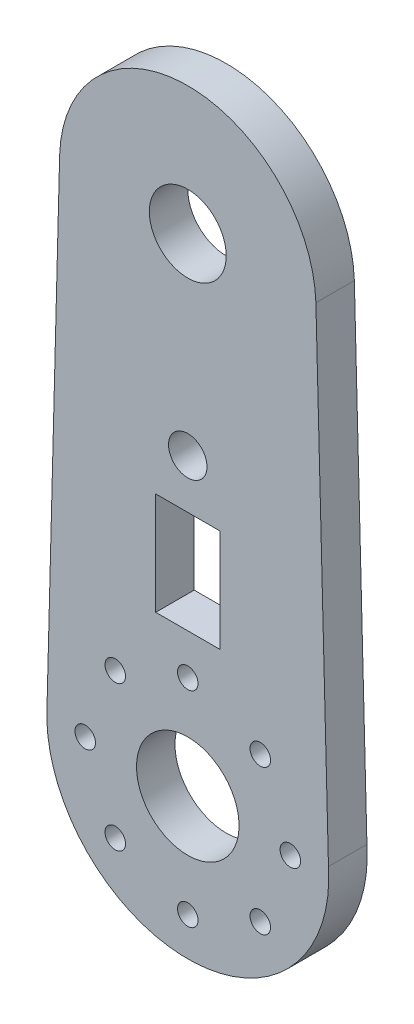
ISO-10303-21;
HEADER;
FILE_DESCRIPTION(('STEP AP214'),'2;1');
FILE_NAME('part.step','',(''),(''),'','','');
FILE_SCHEMA(('AUTOMOTIVE_DESIGN { 1 0 10303 214 1 1 1 1 }'));
ENDSEC;
DATA;
#1=APPLICATION_CONTEXT('core data for automotive mechanical design processes');
#2=APPLICATION_PROTOCOL_DEFINITION('international standard','automotive_design',2000,#1);
#3=PRODUCT_CONTEXT('',#1,'mechanical');
#4=PRODUCT('Part','Part','',(#3));
#5=PRODUCT_RELATED_PRODUCT_CATEGORY('part','',(#4));
#6=PRODUCT_DEFINITION_FORMATION('','',#4);
#7=PRODUCT_DEFINITION_CONTEXT('part definition',#1,'design');
#8=PRODUCT_DEFINITION('design','',#6,#7);
#9=PRODUCT_DEFINITION_SHAPE('','',#8);
#10=(LENGTH_UNIT() NAMED_UNIT(*) SI_UNIT(.MILLI.,.METRE.));
#11=(NAMED_UNIT(*) PLANE_ANGLE_UNIT() SI_UNIT($,.RADIAN.));
#12=(NAMED_UNIT(*) SI_UNIT($,.STERADIAN.) SOLID_ANGLE_UNIT());
#13=UNCERTAINTY_MEASURE_WITH_UNIT(LENGTH_MEASURE(1.E-05),#10,'distance_accuracy_value','');
#14=(GEOMETRIC_REPRESENTATION_CONTEXT(3) GLOBAL_UNCERTAINTY_ASSIGNED_CONTEXT((#13)) GLOBAL_UNIT_ASSIGNED_CONTEXT((#10,
#11,#12)) REPRESENTATION_CONTEXT('',''));
#15=CARTESIAN_POINT('',(0.,0.,0.));
#16=DIRECTION('',(0.,0.,1.));
#17=DIRECTION('',(1.,0.,0.));
#18=AXIS2_PLACEMENT_3D('',#15,#16,#17);
#19=CARTESIAN_POINT('',(0.,0.,0.));
#20=DIRECTION('',(0.,0.,1.));
#21=DIRECTION('',(1.,0.,0.));
#22=AXIS2_PLACEMENT_3D('',#19,#20,#21);
#23=CYLINDRICAL_SURFACE('',#22,10.9999999999999);
#24=CARTESIAN_POINT('',(0.,0.,3.));
#25=DIRECTION('',(0.,0.,1.));
#26=DIRECTION('',(1.,0.,0.));
#27=AXIS2_PLACEMENT_3D('',#24,#25,#26);
#28=CIRCLE('',#27,10.9999999999999);
#29=CARTESIAN_POINT('',(-10.9758499128059,0.728504421097057,3.));
#30=VERTEX_POINT('',#29);
#31=CARTESIAN_POINT('',(10.9758499128058,0.728504421097189,3.));
#32=VERTEX_POINT('',#31);
#33=EDGE_CURVE('E134',#30,#32,#28,.T.);
#34=ORIENTED_EDGE('',*,*,#33,.F.);
#35=DIRECTION('',(0.,0.,1.));
#36=VECTOR('',#35,1.);
#37=CARTESIAN_POINT('',(-10.9758499128059,0.728504421097057,0.));
#38=LINE('',#37,#36);
#39=CARTESIAN_POINT('',(-10.9758499128059,0.728504421097057,0.));
#40=VERTEX_POINT('',#39);
#41=EDGE_CURVE('E11',#40,#30,#38,.T.);
#42=ORIENTED_EDGE('',*,*,#41,.F.);
#43=CARTESIAN_POINT('',(0.,0.,0.));
#44=DIRECTION('',(0.,0.,1.));
#45=DIRECTION('',(1.,0.,0.));
#46=AXIS2_PLACEMENT_3D('',#43,#44,#45);
#47=CIRCLE('',#46,10.9999999999999);
#48=CARTESIAN_POINT('',(10.9758499128058,0.728504421097189,0.));
#49=VERTEX_POINT('',#48);
#50=EDGE_CURVE('E138',#40,#49,#47,.T.);
#51=ORIENTED_EDGE('',*,*,#50,.T.);
#52=DIRECTION('',(0.,0.,1.));
#53=VECTOR('',#52,1.);
#54=CARTESIAN_POINT('',(10.9758499128058,0.728504421097189,0.));
#55=LINE('',#54,#53);
#56=EDGE_CURVE('E35',#49,#32,#55,.T.);
#57=ORIENTED_EDGE('',*,*,#56,.T.);
#58=EDGE_LOOP('',(#34,#42,#51,#57));
#59=FACE_BOUND('',#58,.T.);
#60=ADVANCED_FACE('F32',(#59),#23,.T.);
#61=CARTESIAN_POINT('',(-9.99450983672495,38.3313202734657,0.));
#62=DIRECTION('',(-0.999659633690564,0.0260886329585659,0.));
#63=DIRECTION('',(-0.0260886329585659,-0.999659633690564,0.));
#64=AXIS2_PLACEMENT_3D('',#61,#62,#63);
#65=PLANE('',#64);
#66=DIRECTION('',(-0.0260886329585659,-0.999659633690564,0.));
#67=VECTOR('',#66,1.);
#68=CARTESIAN_POINT('',(-9.99450983672495,38.3313202734657,3.));
#69=LINE('',#68,#67);
#70=CARTESIAN_POINT('',(-9.99450983672495,38.3313202734657,3.));
#71=VERTEX_POINT('',#70);
#72=EDGE_CURVE('E142',#71,#30,#69,.T.);
#73=ORIENTED_EDGE('',*,*,#72,.F.);
#74=DIRECTION('',(0.,0.,1.));
#75=VECTOR('',#74,1.);
#76=CARTESIAN_POINT('',(-9.99450983672495,38.3313202734657,0.));
#77=LINE('',#76,#75);
#78=CARTESIAN_POINT('',(-9.99450983672495,38.3313202734657,0.));
#79=VERTEX_POINT('',#78);
#80=EDGE_CURVE('E40',#79,#71,#77,.T.);
#81=ORIENTED_EDGE('',*,*,#80,.F.);
#82=DIRECTION('',(-0.0260886329585659,-0.999659633690564,0.));
#83=VECTOR('',#82,1.);
#84=CARTESIAN_POINT('',(-9.99450983672495,38.3313202734657,0.));
#85=LINE('',#84,#83);
#86=EDGE_CURVE('E148',#79,#40,#85,.T.);
#87=ORIENTED_EDGE('',*,*,#86,.T.);
#88=ORIENTED_EDGE('',*,*,#41,.T.);
#89=EDGE_LOOP('',(#73,#81,#87,#88));
#90=FACE_BOUND('',#89,.T.);
#91=ADVANCED_FACE('F174',(#90),#65,.T.);
#92=CARTESIAN_POINT('',(0.,38.,0.));
#93=DIRECTION('',(0.,0.,1.));
#94=DIRECTION('',(1.,0.,0.));
#95=AXIS2_PLACEMENT_3D('',#92,#93,#94);
#96=CYLINDRICAL_SURFACE('',#95,10.);
#97=CARTESIAN_POINT('',(0.,38.,3.));
#98=DIRECTION('',(0.,0.,1.));
#99=DIRECTION('',(1.,0.,0.));
#100=AXIS2_PLACEMENT_3D('',#97,#98,#99);
#101=CIRCLE('',#100,10.);
#102=CARTESIAN_POINT('',(9.9945098367248,38.3313202734665,3.));
#103=VERTEX_POINT('',#102);
#104=EDGE_CURVE('E156',#103,#71,#101,.T.);
#105=ORIENTED_EDGE('',*,*,#104,.F.);
#106=DIRECTION('',(0.,0.,1.));
#107=VECTOR('',#106,1.);
#108=CARTESIAN_POINT('',(9.9945098367248,38.3313202734665,0.));
#109=LINE('',#108,#107);
#110=CARTESIAN_POINT('',(9.9945098367248,38.3313202734665,0.));
#111=VERTEX_POINT('',#110);
#112=EDGE_CURVE('E161',#111,#103,#109,.T.);
#113=ORIENTED_EDGE('',*,*,#112,.F.);
#114=CARTESIAN_POINT('',(0.,38.,0.));
#115=DIRECTION('',(0.,0.,1.));
#116=DIRECTION('',(1.,0.,0.));
#117=AXIS2_PLACEMENT_3D('',#114,#115,#116);
#118=CIRCLE('',#117,10.);
#119=EDGE_CURVE('E145',#111,#79,#118,.T.);
#120=ORIENTED_EDGE('',*,*,#119,.T.);
#121=ORIENTED_EDGE('',*,*,#80,.T.);
#122=EDGE_LOOP('',(#105,#113,#120,#121));
#123=FACE_BOUND('',#122,.T.);
#124=ADVANCED_FACE('F178',(#123),#96,.T.);
#125=CARTESIAN_POINT('',(10.9758499128058,0.728504421097189,0.));
#126=DIRECTION('',(0.999659633690564,0.0260886329585659,0.));
#127=DIRECTION('',(-0.0260886329585659,0.999659633690564,0.));
#128=AXIS2_PLACEMENT_3D('',#125,#126,#127);
#129=PLANE('',#128);
#130=DIRECTION('',(-0.0260886329585659,0.999659633690564,0.));
#131=VECTOR('',#130,1.);
#132=CARTESIAN_POINT('',(10.9758499128058,0.728504421097189,3.));
#133=LINE('',#132,#131);
#134=EDGE_CURVE('E153',#32,#103,#133,.T.);
#135=ORIENTED_EDGE('',*,*,#134,.F.);
#136=ORIENTED_EDGE('',*,*,#56,.F.);
#137=DIRECTION('',(-0.0260886329585659,0.999659633690564,0.));
#138=VECTOR('',#137,1.);
#139=CARTESIAN_POINT('',(10.9758499128058,0.728504421097189,0.));
#140=LINE('',#139,#138);
#141=EDGE_CURVE('E141',#49,#111,#140,.T.);
#142=ORIENTED_EDGE('',*,*,#141,.T.);
#143=ORIENTED_EDGE('',*,*,#112,.T.);
#144=EDGE_LOOP('',(#135,#136,#142,#143));
#145=FACE_BOUND('',#144,.T.);
#146=ADVANCED_FACE('F169',(#145),#129,.T.);
#147=CARTESIAN_POINT('',(0.,0.,0.));
#148=DIRECTION('',(0.,0.,1.));
#149=DIRECTION('',(1.,0.,0.));
#150=AXIS2_PLACEMENT_3D('',#147,#148,#149);
#151=PLANE('',#150);
#152=CARTESIAN_POINT('',(-5.65685424949236,5.65685424949241,0.));
#153=DIRECTION('',(0.,0.,1.));
#154=DIRECTION('',(1.,0.,0.));
#155=AXIS2_PLACEMENT_3D('',#152,#153,#154);
#156=CIRCLE('',#155,0.800000000000001);
#157=CARTESIAN_POINT('',(-4.85685424949236,5.65685424949241,0.));
#158=VERTEX_POINT('',#157);
#159=EDGE_CURVE('E373',#158,#158,#156,.T.);
#160=ORIENTED_EDGE('',*,*,#159,.T.);
#161=EDGE_LOOP('',(#160));
#162=FACE_BOUND('',#161,.T.);
#163=CARTESIAN_POINT('',(-7.99999999999932,-7.46069872548105E-13,0.));
#164=DIRECTION('',(0.,0.,1.));
#165=DIRECTION('',(1.,0.,0.));
#166=AXIS2_PLACEMENT_3D('',#163,#164,#165);
#167=CIRCLE('',#166,0.800000000000933);
#168=CARTESIAN_POINT('',(-7.19999999999839,-7.46069872548105E-13,0.));
#169=VERTEX_POINT('',#168);
#170=EDGE_CURVE('E381',#169,#169,#167,.T.);
#171=ORIENTED_EDGE('',*,*,#170,.T.);
#172=EDGE_LOOP('',(#171));
#173=FACE_BOUND('',#172,.T.);
#174=CARTESIAN_POINT('',(0.,23.,0.));
#175=DIRECTION('',(0.,0.,1.));
#176=DIRECTION('',(-1.,0.,0.));
#177=AXIS2_PLACEMENT_3D('',#174,#175,#176);
#178=CIRCLE('',#177,1.5);
#179=CARTESIAN_POINT('',(-1.50000000000006,23.,0.));
#180=VERTEX_POINT('',#179);
#181=EDGE_CURVE('E387',#180,#180,#178,.T.);
#182=ORIENTED_EDGE('',*,*,#181,.T.);
#183=EDGE_LOOP('',(#182));
#184=FACE_BOUND('',#183,.T.);
#185=CARTESIAN_POINT('',(0.,0.,0.));
#186=DIRECTION('',(0.,0.,1.));
#187=DIRECTION('',(-1.,0.,0.));
#188=AXIS2_PLACEMENT_3D('',#185,#186,#187);
#189=CIRCLE('',#188,4.);
#190=CARTESIAN_POINT('',(-4.00000000000006,0.,0.));
#191=VERTEX_POINT('',#190);
#192=EDGE_CURVE('E393',#191,#191,#189,.T.);
#193=ORIENTED_EDGE('',*,*,#192,.T.);
#194=EDGE_LOOP('',(#193));
#195=FACE_BOUND('',#194,.T.);
#196=CARTESIAN_POINT('',(0.,38.,0.));
#197=DIRECTION('',(0.,0.,1.));
#198=DIRECTION('',(-1.,0.,0.));
#199=AXIS2_PLACEMENT_3D('',#196,#197,#198);
#200=CIRCLE('',#199,3.);
#201=CARTESIAN_POINT('',(-3.00000000000006,38.,0.));
#202=VERTEX_POINT('',#201);
#203=EDGE_CURVE('E399',#202,#202,#200,.T.);
#204=ORIENTED_EDGE('',*,*,#203,.T.);
#205=EDGE_LOOP('',(#204));
#206=FACE_BOUND('',#205,.T.);
#207=CARTESIAN_POINT('',(-5.65685424949117,-5.65685424949291,0.));
#208=DIRECTION('',(0.,0.,1.));
#209=DIRECTION('',(1.,0.,0.));
#210=AXIS2_PLACEMENT_3D('',#207,#208,#209);
#211=CIRCLE('',#210,0.800000000001323);
#212=CARTESIAN_POINT('',(-4.85685424948985,-5.65685424949291,0.));
#213=VERTEX_POINT('',#212);
#214=EDGE_CURVE('E405',#213,#213,#211,.T.);
#215=ORIENTED_EDGE('',*,*,#214,.T.);
#216=EDGE_LOOP('',(#215));
#217=FACE_BOUND('',#216,.T.);
#218=CARTESIAN_POINT('',(1.42800782021757E-12,-8.,0.));
#219=DIRECTION('',(0.,0.,1.));
#220=DIRECTION('',(1.,0.,0.));
#221=AXIS2_PLACEMENT_3D('',#218,#219,#220);
#222=CIRCLE('',#221,0.80000000000136);
#223=CARTESIAN_POINT('',(0.800000000002788,-8.,0.));
#224=VERTEX_POINT('',#223);
#225=EDGE_CURVE('E411',#224,#224,#222,.T.);
#226=ORIENTED_EDGE('',*,*,#225,.T.);
#227=EDGE_LOOP('',(#226));
#228=FACE_BOUND('',#227,.T.);
#229=CARTESIAN_POINT('',(5.65685424949359,-5.65685424949185,0.));
#230=DIRECTION('',(0.,0.,1.));
#231=DIRECTION('',(1.,0.,0.));
#232=AXIS2_PLACEMENT_3D('',#229,#230,#231);
#233=CIRCLE('',#232,0.800000000001012);
#234=CARTESIAN_POINT('',(6.4568542494946,-5.65685424949185,0.));
#235=VERTEX_POINT('',#234);
#236=EDGE_CURVE('E417',#235,#235,#233,.T.);
#237=ORIENTED_EDGE('',*,*,#236,.T.);
#238=EDGE_LOOP('',(#237));
#239=FACE_BOUND('',#238,.T.);
#240=CARTESIAN_POINT('',(8.00000000000068,7.45090155108787E-13,0.));
#241=DIRECTION('',(0.,0.,1.));
#242=DIRECTION('',(1.,0.,0.));
#243=AXIS2_PLACEMENT_3D('',#240,#241,#242);
#244=CIRCLE('',#243,0.80000000000048);
#245=CARTESIAN_POINT('',(8.80000000000116,7.45090155108787E-13,0.));
#246=VERTEX_POINT('',#245);
#247=EDGE_CURVE('E423',#246,#246,#244,.T.);
#248=ORIENTED_EDGE('',*,*,#247,.T.);
#249=EDGE_LOOP('',(#248));
#250=FACE_BOUND('',#249,.T.);
#251=CARTESIAN_POINT('',(5.65685424949235,5.65685424949242,0.));
#252=DIRECTION('',(0.,0.,1.));
#253=DIRECTION('',(1.,0.,0.));
#254=AXIS2_PLACEMENT_3D('',#251,#252,#253);
#255=CIRCLE('',#254,0.8);
#256=CARTESIAN_POINT('',(6.45685424949235,5.65685424949242,0.));
#257=VERTEX_POINT('',#256);
#258=EDGE_CURVE('E429',#257,#257,#255,.T.);
#259=ORIENTED_EDGE('',*,*,#258,.T.);
#260=EDGE_LOOP('',(#259));
#261=FACE_BOUND('',#260,.T.);
#262=CARTESIAN_POINT('',(0.,8.,0.));
#263=DIRECTION('',(0.,0.,1.));
#264=DIRECTION('',(1.,0.,0.));
#265=AXIS2_PLACEMENT_3D('',#262,#263,#264);
#266=CIRCLE('',#265,0.8);
#267=CARTESIAN_POINT('',(0.799999999999938,8.,0.));
#268=VERTEX_POINT('',#267);
#269=EDGE_CURVE('E128',#268,#268,#266,.T.);
#270=ORIENTED_EDGE('',*,*,#269,.T.);
#271=EDGE_LOOP('',(#270));
#272=FACE_BOUND('',#271,.T.);
#273=DIRECTION('',(-1.,0.,0.));
#274=VECTOR('',#273,1.);
#275=CARTESIAN_POINT('',(-2.50000000000006,19.1690504121899,0.));
#276=LINE('',#275,#274);
#277=CARTESIAN_POINT('',(2.49999999999994,19.1690504121899,0.));
#278=VERTEX_POINT('',#277);
#279=CARTESIAN_POINT('',(-2.50000000000006,19.1690504121899,0.));
#280=VERTEX_POINT('',#279);
#281=EDGE_CURVE('E105',#278,#280,#276,.T.);
#282=ORIENTED_EDGE('',*,*,#281,.T.);
#283=DIRECTION('',(0.,-1.,0.));
#284=VECTOR('',#283,1.);
#285=CARTESIAN_POINT('',(-2.50000000000006,11.1690504121899,0.));
#286=LINE('',#285,#284);
#287=CARTESIAN_POINT('',(-2.50000000000006,11.1690504121899,0.));
#288=VERTEX_POINT('',#287);
#289=EDGE_CURVE('E99',#280,#288,#286,.T.);
#290=ORIENTED_EDGE('',*,*,#289,.T.);
#291=DIRECTION('',(1.,0.,0.));
#292=VECTOR('',#291,1.);
#293=CARTESIAN_POINT('',(-2.50000000000006,11.1690504121899,0.));
#294=LINE('',#293,#292);
#295=CARTESIAN_POINT('',(2.49999999999994,11.1690504121899,0.));
#296=VERTEX_POINT('',#295);
#297=EDGE_CURVE('E108',#288,#296,#294,.T.);
#298=ORIENTED_EDGE('',*,*,#297,.T.);
#299=DIRECTION('',(0.,1.,0.));
#300=VECTOR('',#299,1.);
#301=CARTESIAN_POINT('',(2.49999999999994,11.1690504121899,0.));
#302=LINE('',#301,#300);
#303=EDGE_CURVE('E48',#296,#278,#302,.T.);
#304=ORIENTED_EDGE('',*,*,#303,.T.);
#305=EDGE_LOOP('',(#282,#290,#298,#304));
#306=FACE_BOUND('',#305,.T.);
#307=ORIENTED_EDGE('',*,*,#50,.F.);
#308=ORIENTED_EDGE('',*,*,#86,.F.);
#309=ORIENTED_EDGE('',*,*,#119,.F.);
#310=ORIENTED_EDGE('',*,*,#141,.F.);
#311=EDGE_LOOP('',(#307,#308,#309,#310));
#312=FACE_BOUND('',#311,.T.);
#313=ADVANCED_FACE('F112',(#162,#173,#184,#195,#206,#217,#228,#239,#250,#261,#272,#306,#312),
#151,.F.);
#314=CARTESIAN_POINT('',(0.,0.,3.));
#315=DIRECTION('',(0.,0.,1.));
#316=DIRECTION('',(1.,0.,0.));
#317=AXIS2_PLACEMENT_3D('',#314,#315,#316);
#318=PLANE('',#317);
#319=CARTESIAN_POINT('',(-5.65685424949236,5.65685424949241,3.));
#320=DIRECTION('',(0.,0.,1.));
#321=DIRECTION('',(1.,0.,0.));
#322=AXIS2_PLACEMENT_3D('',#319,#320,#321);
#323=CIRCLE('',#322,0.800000000000001);
#324=CARTESIAN_POINT('',(-4.85685424949236,5.65685424949241,3.));
#325=VERTEX_POINT('',#324);
#326=EDGE_CURVE('E376',#325,#325,#323,.T.);
#327=ORIENTED_EDGE('',*,*,#326,.F.);
#328=EDGE_LOOP('',(#327));
#329=FACE_BOUND('',#328,.T.);
#330=CARTESIAN_POINT('',(-7.99999999999932,-7.46069872548105E-13,3.));
#331=DIRECTION('',(0.,0.,1.));
#332=DIRECTION('',(1.,0.,0.));
#333=AXIS2_PLACEMENT_3D('',#330,#331,#332);
#334=CIRCLE('',#333,0.800000000000933);
#335=CARTESIAN_POINT('',(-7.19999999999839,-7.46069872548105E-13,3.));
#336=VERTEX_POINT('',#335);
#337=EDGE_CURVE('E378',#336,#336,#334,.T.);
#338=ORIENTED_EDGE('',*,*,#337,.F.);
#339=EDGE_LOOP('',(#338));
#340=FACE_BOUND('',#339,.T.);
#341=CARTESIAN_POINT('',(0.,23.,3.));
#342=DIRECTION('',(0.,0.,1.));
#343=DIRECTION('',(-1.,0.,0.));
#344=AXIS2_PLACEMENT_3D('',#341,#342,#343);
#345=CIRCLE('',#344,1.5);
#346=CARTESIAN_POINT('',(-1.50000000000006,23.,3.));
#347=VERTEX_POINT('',#346);
#348=EDGE_CURVE('E384',#347,#347,#345,.T.);
#349=ORIENTED_EDGE('',*,*,#348,.F.);
#350=EDGE_LOOP('',(#349));
#351=FACE_BOUND('',#350,.T.);
#352=CARTESIAN_POINT('',(0.,0.,3.));
#353=DIRECTION('',(0.,0.,1.));
#354=DIRECTION('',(-1.,0.,0.));
#355=AXIS2_PLACEMENT_3D('',#352,#353,#354);
#356=CIRCLE('',#355,4.);
#357=CARTESIAN_POINT('',(-4.00000000000006,0.,3.));
#358=VERTEX_POINT('',#357);
#359=EDGE_CURVE('E390',#358,#358,#356,.T.);
#360=ORIENTED_EDGE('',*,*,#359,.F.);
#361=EDGE_LOOP('',(#360));
#362=FACE_BOUND('',#361,.T.);
#363=CARTESIAN_POINT('',(0.,38.,3.));
#364=DIRECTION('',(0.,0.,1.));
#365=DIRECTION('',(-1.,0.,0.));
#366=AXIS2_PLACEMENT_3D('',#363,#364,#365);
#367=CIRCLE('',#366,3.);
#368=CARTESIAN_POINT('',(-3.00000000000006,38.,3.));
#369=VERTEX_POINT('',#368);
#370=EDGE_CURVE('E396',#369,#369,#367,.T.);
#371=ORIENTED_EDGE('',*,*,#370,.F.);
#372=EDGE_LOOP('',(#371));
#373=FACE_BOUND('',#372,.T.);
#374=CARTESIAN_POINT('',(-5.65685424949117,-5.65685424949291,3.));
#375=DIRECTION('',(0.,0.,1.));
#376=DIRECTION('',(1.,0.,0.));
#377=AXIS2_PLACEMENT_3D('',#374,#375,#376);
#378=CIRCLE('',#377,0.800000000001323);
#379=CARTESIAN_POINT('',(-4.85685424948985,-5.65685424949291,3.));
#380=VERTEX_POINT('',#379);
#381=EDGE_CURVE('E402',#380,#380,#378,.T.);
#382=ORIENTED_EDGE('',*,*,#381,.F.);
#383=EDGE_LOOP('',(#382));
#384=FACE_BOUND('',#383,.T.);
#385=CARTESIAN_POINT('',(1.42800782021757E-12,-8.,3.));
#386=DIRECTION('',(0.,0.,1.));
#387=DIRECTION('',(1.,0.,0.));
#388=AXIS2_PLACEMENT_3D('',#385,#386,#387);
#389=CIRCLE('',#388,0.80000000000136);
#390=CARTESIAN_POINT('',(0.800000000002788,-8.,3.));
#391=VERTEX_POINT('',#390);
#392=EDGE_CURVE('E408',#391,#391,#389,.T.);
#393=ORIENTED_EDGE('',*,*,#392,.F.);
#394=EDGE_LOOP('',(#393));
#395=FACE_BOUND('',#394,.T.);
#396=CARTESIAN_POINT('',(5.65685424949359,-5.65685424949185,3.));
#397=DIRECTION('',(0.,0.,1.));
#398=DIRECTION('',(1.,0.,0.));
#399=AXIS2_PLACEMENT_3D('',#396,#397,#398);
#400=CIRCLE('',#399,0.800000000001012);
#401=CARTESIAN_POINT('',(6.4568542494946,-5.65685424949185,3.));
#402=VERTEX_POINT('',#401);
#403=EDGE_CURVE('E414',#402,#402,#400,.T.);
#404=ORIENTED_EDGE('',*,*,#403,.F.);
#405=EDGE_LOOP('',(#404));
#406=FACE_BOUND('',#405,.T.);
#407=CARTESIAN_POINT('',(8.00000000000068,7.45090155108787E-13,3.));
#408=DIRECTION('',(0.,0.,1.));
#409=DIRECTION('',(1.,0.,0.));
#410=AXIS2_PLACEMENT_3D('',#407,#408,#409);
#411=CIRCLE('',#410,0.80000000000048);
#412=CARTESIAN_POINT('',(8.80000000000116,7.45090155108787E-13,3.));
#413=VERTEX_POINT('',#412);
#414=EDGE_CURVE('E420',#413,#413,#411,.T.);
#415=ORIENTED_EDGE('',*,*,#414,.F.);
#416=EDGE_LOOP('',(#415));
#417=FACE_BOUND('',#416,.T.);
#418=CARTESIAN_POINT('',(5.65685424949235,5.65685424949242,3.));
#419=DIRECTION('',(0.,0.,1.));
#420=DIRECTION('',(1.,0.,0.));
#421=AXIS2_PLACEMENT_3D('',#418,#419,#420);
#422=CIRCLE('',#421,0.8);
#423=CARTESIAN_POINT('',(6.45685424949235,5.65685424949242,3.));
#424=VERTEX_POINT('',#423);
#425=EDGE_CURVE('E426',#424,#424,#422,.T.);
#426=ORIENTED_EDGE('',*,*,#425,.F.);
#427=EDGE_LOOP('',(#426));
#428=FACE_BOUND('',#427,.T.);
#429=CARTESIAN_POINT('',(0.,8.,3.));
#430=DIRECTION('',(0.,0.,1.));
#431=DIRECTION('',(1.,0.,0.));
#432=AXIS2_PLACEMENT_3D('',#429,#430,#431);
#433=CIRCLE('',#432,0.8);
#434=CARTESIAN_POINT('',(0.799999999999938,8.,3.));
#435=VERTEX_POINT('',#434);
#436=EDGE_CURVE('E121',#435,#435,#433,.T.);
#437=ORIENTED_EDGE('',*,*,#436,.F.);
#438=EDGE_LOOP('',(#437));
#439=FACE_BOUND('',#438,.T.);
#440=DIRECTION('',(0.,-1.,0.));
#441=VECTOR('',#440,1.);
#442=CARTESIAN_POINT('',(-2.50000000000006,11.1690504121899,3.));
#443=LINE('',#442,#441);
#444=CARTESIAN_POINT('',(-2.50000000000006,19.1690504121899,3.));
#445=VERTEX_POINT('',#444);
#446=CARTESIAN_POINT('',(-2.50000000000006,11.1690504121899,3.));
#447=VERTEX_POINT('',#446);
#448=EDGE_CURVE('E56',#445,#447,#443,.T.);
#449=ORIENTED_EDGE('',*,*,#448,.F.);
#450=DIRECTION('',(-1.,0.,0.));
#451=VECTOR('',#450,1.);
#452=CARTESIAN_POINT('',(-2.50000000000006,19.1690504121899,3.));
#453=LINE('',#452,#451);
#454=CARTESIAN_POINT('',(2.49999999999994,19.1690504121899,3.));
#455=VERTEX_POINT('',#454);
#456=EDGE_CURVE('E115',#455,#445,#453,.T.);
#457=ORIENTED_EDGE('',*,*,#456,.F.);
#458=DIRECTION('',(0.,1.,0.));
#459=VECTOR('',#458,1.);
#460=CARTESIAN_POINT('',(2.49999999999994,11.1690504121899,3.));
#461=LINE('',#460,#459);
#462=CARTESIAN_POINT('',(2.49999999999994,11.1690504121899,3.));
#463=VERTEX_POINT('',#462);
#464=EDGE_CURVE('E118',#463,#455,#461,.T.);
#465=ORIENTED_EDGE('',*,*,#464,.F.);
#466=DIRECTION('',(1.,0.,0.));
#467=VECTOR('',#466,1.);
#468=CARTESIAN_POINT('',(-2.50000000000006,11.1690504121899,3.));
#469=LINE('',#468,#467);
#470=EDGE_CURVE('E127',#447,#463,#469,.T.);
#471=ORIENTED_EDGE('',*,*,#470,.F.);
#472=EDGE_LOOP('',(#449,#457,#465,#471));
#473=FACE_BOUND('',#472,.T.);
#474=ORIENTED_EDGE('',*,*,#33,.T.);
#475=ORIENTED_EDGE('',*,*,#134,.T.);
#476=ORIENTED_EDGE('',*,*,#104,.T.);
#477=ORIENTED_EDGE('',*,*,#72,.T.);
#478=EDGE_LOOP('',(#474,#475,#476,#477));
#479=FACE_BOUND('',#478,.T.);
#480=ADVANCED_FACE('F171',(#329,#340,#351,#362,#373,#384,#395,#406,#417,#428,#439,#473,#479),
#318,.T.);
#481=CARTESIAN_POINT('',(-2.50000000000006,11.1690504121899,0.));
#482=DIRECTION('',(-1.,0.,0.));
#483=DIRECTION('',(0.,0.,1.));
#484=AXIS2_PLACEMENT_3D('',#481,#482,#483);
#485=PLANE('',#484);
#486=ORIENTED_EDGE('',*,*,#448,.T.);
#487=DIRECTION('',(0.,0.,1.));
#488=VECTOR('',#487,1.);
#489=CARTESIAN_POINT('',(-2.50000000000006,11.1690504121899,0.));
#490=LINE('',#489,#488);
#491=EDGE_CURVE('E95',#288,#447,#490,.T.);
#492=ORIENTED_EDGE('',*,*,#491,.F.);
#493=ORIENTED_EDGE('',*,*,#289,.F.);
#494=DIRECTION('',(0.,0.,1.));
#495=VECTOR('',#494,1.);
#496=CARTESIAN_POINT('',(-2.50000000000006,19.1690504121899,0.));
#497=LINE('',#496,#495);
#498=EDGE_CURVE('E132',#280,#445,#497,.T.);
#499=ORIENTED_EDGE('',*,*,#498,.T.);
#500=EDGE_LOOP('',(#486,#492,#493,#499));
#501=FACE_BOUND('',#500,.T.);
#502=ADVANCED_FACE('F97',(#501),#485,.F.);
#503=CARTESIAN_POINT('',(-2.50000000000006,19.1690504121899,0.));
#504=DIRECTION('',(0.,1.,0.));
#505=DIRECTION('',(0.,0.,1.));
#506=AXIS2_PLACEMENT_3D('',#503,#504,#505);
#507=PLANE('',#506);
#508=ORIENTED_EDGE('',*,*,#456,.T.);
#509=ORIENTED_EDGE('',*,*,#498,.F.);
#510=ORIENTED_EDGE('',*,*,#281,.F.);
#511=DIRECTION('',(0.,0.,1.));
#512=VECTOR('',#511,1.);
#513=CARTESIAN_POINT('',(2.49999999999994,19.1690504121899,0.));
#514=LINE('',#513,#512);
#515=EDGE_CURVE('E135',#278,#455,#514,.T.);
#516=ORIENTED_EDGE('',*,*,#515,.T.);
#517=EDGE_LOOP('',(#508,#509,#510,#516));
#518=FACE_BOUND('',#517,.T.);
#519=ADVANCED_FACE('F230',(#518),#507,.F.);
#520=CARTESIAN_POINT('',(2.49999999999994,11.1690504121899,0.));
#521=DIRECTION('',(1.,0.,0.));
#522=DIRECTION('',(0.,1.,0.));
#523=AXIS2_PLACEMENT_3D('',#520,#521,#522);
#524=PLANE('',#523);
#525=ORIENTED_EDGE('',*,*,#464,.T.);
#526=ORIENTED_EDGE('',*,*,#515,.F.);
#527=ORIENTED_EDGE('',*,*,#303,.F.);
#528=DIRECTION('',(0.,0.,1.));
#529=VECTOR('',#528,1.);
#530=CARTESIAN_POINT('',(2.49999999999994,11.1690504121899,0.));
#531=LINE('',#530,#529);
#532=EDGE_CURVE('E104',#296,#463,#531,.T.);
#533=ORIENTED_EDGE('',*,*,#532,.T.);
#534=EDGE_LOOP('',(#525,#526,#527,#533));
#535=FACE_BOUND('',#534,.T.);
#536=ADVANCED_FACE('F239',(#535),#524,.F.);
#537=CARTESIAN_POINT('',(-2.50000000000006,11.1690504121899,0.));
#538=DIRECTION('',(0.,-1.,0.));
#539=DIRECTION('',(0.,0.,-1.));
#540=AXIS2_PLACEMENT_3D('',#537,#538,#539);
#541=PLANE('',#540);
#542=ORIENTED_EDGE('',*,*,#470,.T.);
#543=ORIENTED_EDGE('',*,*,#532,.F.);
#544=ORIENTED_EDGE('',*,*,#297,.F.);
#545=ORIENTED_EDGE('',*,*,#491,.T.);
#546=EDGE_LOOP('',(#542,#543,#544,#545));
#547=FACE_BOUND('',#546,.T.);
#548=ADVANCED_FACE('F109',(#547),#541,.F.);
#549=CARTESIAN_POINT('',(0.,8.,0.));
#550=DIRECTION('',(0.,0.,1.));
#551=DIRECTION('',(1.,0.,0.));
#552=AXIS2_PLACEMENT_3D('',#549,#550,#551);
#553=CYLINDRICAL_SURFACE('',#552,0.8);
#554=ORIENTED_EDGE('',*,*,#269,.F.);
#555=EDGE_LOOP('',(#554));
#556=FACE_BOUND('',#555,.T.);
#557=ORIENTED_EDGE('',*,*,#436,.T.);
#558=EDGE_LOOP('',(#557));
#559=FACE_BOUND('',#558,.T.);
#560=ADVANCED_FACE('F257',(#556,#559),#553,.F.);
#561=CARTESIAN_POINT('',(5.65685424949235,5.65685424949242,0.));
#562=DIRECTION('',(0.,0.,1.));
#563=DIRECTION('',(1.,0.,0.));
#564=AXIS2_PLACEMENT_3D('',#561,#562,#563);
#565=CYLINDRICAL_SURFACE('',#564,0.8);
#566=ORIENTED_EDGE('',*,*,#258,.F.);
#567=EDGE_LOOP('',(#566));
#568=FACE_BOUND('',#567,.T.);
#569=ORIENTED_EDGE('',*,*,#425,.T.);
#570=EDGE_LOOP('',(#569));
#571=FACE_BOUND('',#570,.T.);
#572=ADVANCED_FACE('F266',(#568,#571),#565,.F.);
#573=CARTESIAN_POINT('',(8.00000000000068,7.45090155108787E-13,0.));
#574=DIRECTION('',(0.,0.,1.));
#575=DIRECTION('',(1.,0.,0.));
#576=AXIS2_PLACEMENT_3D('',#573,#574,#575);
#577=CYLINDRICAL_SURFACE('',#576,0.80000000000048);
#578=ORIENTED_EDGE('',*,*,#247,.F.);
#579=EDGE_LOOP('',(#578));
#580=FACE_BOUND('',#579,.T.);
#581=ORIENTED_EDGE('',*,*,#414,.T.);
#582=EDGE_LOOP('',(#581));
#583=FACE_BOUND('',#582,.T.);
#584=ADVANCED_FACE('F276',(#580,#583),#577,.F.);
#585=CARTESIAN_POINT('',(5.65685424949359,-5.65685424949185,0.));
#586=DIRECTION('',(0.,0.,1.));
#587=DIRECTION('',(1.,0.,0.));
#588=AXIS2_PLACEMENT_3D('',#585,#586,#587);
#589=CYLINDRICAL_SURFACE('',#588,0.800000000001012);
#590=ORIENTED_EDGE('',*,*,#236,.F.);
#591=EDGE_LOOP('',(#590));
#592=FACE_BOUND('',#591,.T.);
#593=ORIENTED_EDGE('',*,*,#403,.T.);
#594=EDGE_LOOP('',(#593));
#595=FACE_BOUND('',#594,.T.);
#596=ADVANCED_FACE('F286',(#592,#595),#589,.F.);
#597=CARTESIAN_POINT('',(1.42800782021757E-12,-8.,0.));
#598=DIRECTION('',(0.,0.,1.));
#599=DIRECTION('',(1.,0.,0.));
#600=AXIS2_PLACEMENT_3D('',#597,#598,#599);
#601=CYLINDRICAL_SURFACE('',#600,0.80000000000136);
#602=ORIENTED_EDGE('',*,*,#225,.F.);
#603=EDGE_LOOP('',(#602));
#604=FACE_BOUND('',#603,.T.);
#605=ORIENTED_EDGE('',*,*,#392,.T.);
#606=EDGE_LOOP('',(#605));
#607=FACE_BOUND('',#606,.T.);
#608=ADVANCED_FACE('F296',(#604,#607),#601,.F.);
#609=CARTESIAN_POINT('',(-5.65685424949117,-5.65685424949291,0.));
#610=DIRECTION('',(0.,0.,1.));
#611=DIRECTION('',(1.,0.,0.));
#612=AXIS2_PLACEMENT_3D('',#609,#610,#611);
#613=CYLINDRICAL_SURFACE('',#612,0.800000000001323);
#614=ORIENTED_EDGE('',*,*,#214,.F.);
#615=EDGE_LOOP('',(#614));
#616=FACE_BOUND('',#615,.T.);
#617=ORIENTED_EDGE('',*,*,#381,.T.);
#618=EDGE_LOOP('',(#617));
#619=FACE_BOUND('',#618,.T.);
#620=ADVANCED_FACE('F306',(#616,#619),#613,.F.);
#621=CARTESIAN_POINT('',(0.,38.,0.));
#622=DIRECTION('',(0.,0.,1.));
#623=DIRECTION('',(1.,0.,0.));
#624=AXIS2_PLACEMENT_3D('',#621,#622,#623);
#625=CYLINDRICAL_SURFACE('',#624,3.);
#626=ORIENTED_EDGE('',*,*,#203,.F.);
#627=EDGE_LOOP('',(#626));
#628=FACE_BOUND('',#627,.T.);
#629=ORIENTED_EDGE('',*,*,#370,.T.);
#630=EDGE_LOOP('',(#629));
#631=FACE_BOUND('',#630,.T.);
#632=ADVANCED_FACE('F316',(#628,#631),#625,.F.);
#633=CARTESIAN_POINT('',(0.,0.,0.));
#634=DIRECTION('',(0.,0.,1.));
#635=DIRECTION('',(1.,0.,0.));
#636=AXIS2_PLACEMENT_3D('',#633,#634,#635);
#637=CYLINDRICAL_SURFACE('',#636,4.);
#638=ORIENTED_EDGE('',*,*,#192,.F.);
#639=EDGE_LOOP('',(#638));
#640=FACE_BOUND('',#639,.T.);
#641=ORIENTED_EDGE('',*,*,#359,.T.);
#642=EDGE_LOOP('',(#641));
#643=FACE_BOUND('',#642,.T.);
#644=ADVANCED_FACE('F326',(#640,#643),#637,.F.);
#645=CARTESIAN_POINT('',(0.,23.,0.));
#646=DIRECTION('',(0.,0.,1.));
#647=DIRECTION('',(1.,0.,0.));
#648=AXIS2_PLACEMENT_3D('',#645,#646,#647);
#649=CYLINDRICAL_SURFACE('',#648,1.5);
#650=ORIENTED_EDGE('',*,*,#181,.F.);
#651=EDGE_LOOP('',(#650));
#652=FACE_BOUND('',#651,.T.);
#653=ORIENTED_EDGE('',*,*,#348,.T.);
#654=EDGE_LOOP('',(#653));
#655=FACE_BOUND('',#654,.T.);
#656=ADVANCED_FACE('F336',(#652,#655),#649,.F.);
#657=CARTESIAN_POINT('',(-7.99999999999932,-7.46069872548105E-13,0.));
#658=DIRECTION('',(0.,0.,1.));
#659=DIRECTION('',(1.,0.,0.));
#660=AXIS2_PLACEMENT_3D('',#657,#658,#659);
#661=CYLINDRICAL_SURFACE('',#660,0.800000000000933);
#662=ORIENTED_EDGE('',*,*,#170,.F.);
#663=EDGE_LOOP('',(#662));
#664=FACE_BOUND('',#663,.T.);
#665=ORIENTED_EDGE('',*,*,#337,.T.);
#666=EDGE_LOOP('',(#665));
#667=FACE_BOUND('',#666,.T.);
#668=ADVANCED_FACE('F346',(#664,#667),#661,.F.);
#669=CARTESIAN_POINT('',(-5.65685424949236,5.65685424949241,0.));
#670=DIRECTION('',(0.,0.,1.));
#671=DIRECTION('',(1.,0.,0.));
#672=AXIS2_PLACEMENT_3D('',#669,#670,#671);
#673=CYLINDRICAL_SURFACE('',#672,0.800000000000001);
#674=ORIENTED_EDGE('',*,*,#159,.F.);
#675=EDGE_LOOP('',(#674));
#676=FACE_BOUND('',#675,.T.);
#677=ORIENTED_EDGE('',*,*,#326,.T.);
#678=EDGE_LOOP('',(#677));
#679=FACE_BOUND('',#678,.T.);
#680=ADVANCED_FACE('F356',(#676,#679),#673,.F.);
#681=CLOSED_SHELL('',(#60,#91,#124,#146,#313,#480,#502,#519,#536,#548,#560,#572,#584,#596,#608,
#620,#632,#644,#656,#668,#680));
#682=MANIFOLD_SOLID_BREP('B2',#681);
#683=ADVANCED_BREP_SHAPE_REPRESENTATION('',(#18,#682),#14);
#684=SHAPE_DEFINITION_REPRESENTATION(#9,#683);
ENDSEC;
END-ISO-10303-21;
